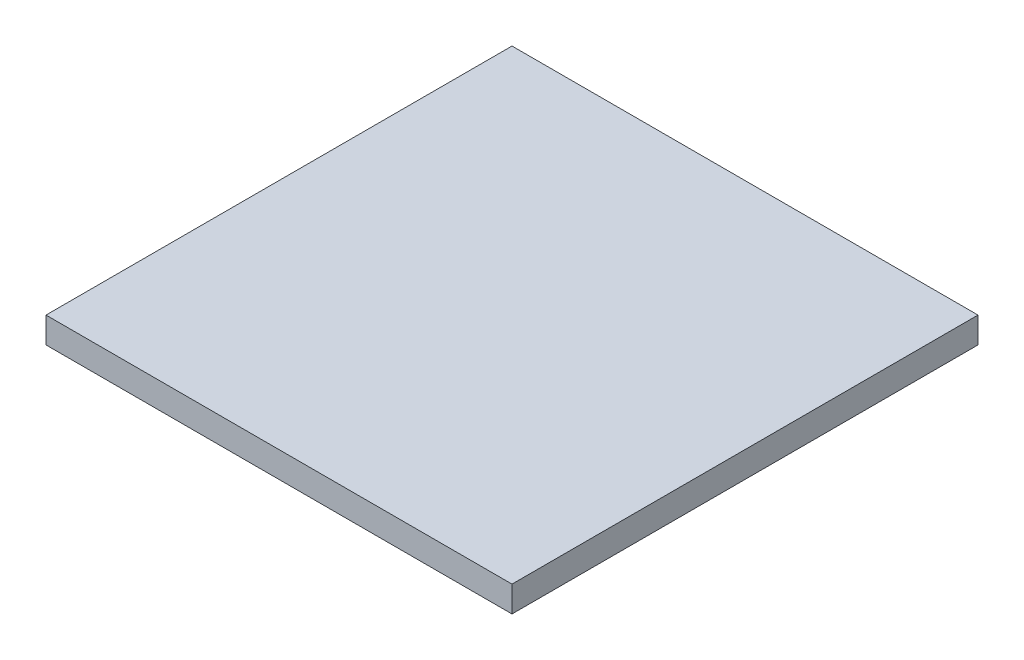
ISO-10303-21;
HEADER;
FILE_DESCRIPTION(('STEP AP214'),'2;1');
FILE_NAME('part.step','',(''),(''),'','','');
FILE_SCHEMA(('AUTOMOTIVE_DESIGN { 1 0 10303 214 1 1 1 1 }'));
ENDSEC;
DATA;
#1=APPLICATION_CONTEXT('core data for automotive mechanical design processes');
#2=APPLICATION_PROTOCOL_DEFINITION('international standard','automotive_design',2000,#1);
#3=PRODUCT_CONTEXT('',#1,'mechanical');
#4=PRODUCT('Part','Part','',(#3));
#5=PRODUCT_RELATED_PRODUCT_CATEGORY('part','',(#4));
#6=PRODUCT_DEFINITION_FORMATION('','',#4);
#7=PRODUCT_DEFINITION_CONTEXT('part definition',#1,'design');
#8=PRODUCT_DEFINITION('design','',#6,#7);
#9=PRODUCT_DEFINITION_SHAPE('','',#8);
#10=(LENGTH_UNIT() NAMED_UNIT(*) SI_UNIT(.MILLI.,.METRE.));
#11=(NAMED_UNIT(*) PLANE_ANGLE_UNIT() SI_UNIT($,.RADIAN.));
#12=(NAMED_UNIT(*) SI_UNIT($,.STERADIAN.) SOLID_ANGLE_UNIT());
#13=UNCERTAINTY_MEASURE_WITH_UNIT(LENGTH_MEASURE(1.E-05),#10,'distance_accuracy_value','');
#14=(GEOMETRIC_REPRESENTATION_CONTEXT(3) GLOBAL_UNCERTAINTY_ASSIGNED_CONTEXT((#13)) GLOBAL_UNIT_ASSIGNED_CONTEXT((#10,
#11,#12)) REPRESENTATION_CONTEXT('',''));
#15=CARTESIAN_POINT('',(0.,0.,0.));
#16=DIRECTION('',(0.,0.,1.));
#17=DIRECTION('',(1.,0.,0.));
#18=AXIS2_PLACEMENT_3D('',#15,#16,#17);
#19=CARTESIAN_POINT('',(-3.15,0.35,-3.15));
#20=DIRECTION('',(1.,0.,0.));
#21=DIRECTION('',(0.,0.,-1.));
#22=AXIS2_PLACEMENT_3D('',#19,#20,#21);
#23=PLANE('',#22);
#24=DIRECTION('',(0.,0.,1.));
#25=VECTOR('',#24,1.);
#26=CARTESIAN_POINT('',(-3.15,0.,-3.15));
#27=LINE('',#26,#25);
#28=CARTESIAN_POINT('',(-3.15,0.,-3.15));
#29=VERTEX_POINT('',#28);
#30=CARTESIAN_POINT('',(-3.15,0.,3.15));
#31=VERTEX_POINT('',#30);
#32=EDGE_CURVE('E100',#29,#31,#27,.T.);
#33=ORIENTED_EDGE('',*,*,#32,.T.);
#34=DIRECTION('',(0.,-1.,0.));
#35=VECTOR('',#34,1.);
#36=CARTESIAN_POINT('',(-3.15,0.35,3.15));
#37=LINE('',#36,#35);
#38=CARTESIAN_POINT('',(-3.15,0.35,3.15));
#39=VERTEX_POINT('',#38);
#40=EDGE_CURVE('E11',#39,#31,#37,.T.);
#41=ORIENTED_EDGE('',*,*,#40,.F.);
#42=DIRECTION('',(0.,0.,1.));
#43=VECTOR('',#42,1.);
#44=CARTESIAN_POINT('',(-3.15,0.35,-3.15));
#45=LINE('',#44,#43);
#46=CARTESIAN_POINT('',(-3.15,0.35,-3.15));
#47=VERTEX_POINT('',#46);
#48=EDGE_CURVE('E88',#47,#39,#45,.T.);
#49=ORIENTED_EDGE('',*,*,#48,.F.);
#50=DIRECTION('',(0.,-1.,0.));
#51=VECTOR('',#50,1.);
#52=CARTESIAN_POINT('',(-3.15,0.35,-3.15));
#53=LINE('',#52,#51);
#54=EDGE_CURVE('E96',#47,#29,#53,.T.);
#55=ORIENTED_EDGE('',*,*,#54,.T.);
#56=EDGE_LOOP('',(#33,#41,#49,#55));
#57=FACE_BOUND('',#56,.T.);
#58=ADVANCED_FACE('F37',(#57),#23,.F.);
#59=CARTESIAN_POINT('',(-3.15,0.35,3.15));
#60=DIRECTION('',(0.,0.,-1.));
#61=DIRECTION('',(-1.,0.,0.));
#62=AXIS2_PLACEMENT_3D('',#59,#60,#61);
#63=PLANE('',#62);
#64=DIRECTION('',(1.,0.,0.));
#65=VECTOR('',#64,1.);
#66=CARTESIAN_POINT('',(-3.15,0.,3.15));
#67=LINE('',#66,#65);
#68=CARTESIAN_POINT('',(3.15,0.,3.15));
#69=VERTEX_POINT('',#68);
#70=EDGE_CURVE('E92',#31,#69,#67,.T.);
#71=ORIENTED_EDGE('',*,*,#70,.T.);
#72=DIRECTION('',(0.,-1.,0.));
#73=VECTOR('',#72,1.);
#74=CARTESIAN_POINT('',(3.15,0.35,3.15));
#75=LINE('',#74,#73);
#76=CARTESIAN_POINT('',(3.15,0.35,3.15));
#77=VERTEX_POINT('',#76);
#78=EDGE_CURVE('E45',#77,#69,#75,.T.);
#79=ORIENTED_EDGE('',*,*,#78,.F.);
#80=DIRECTION('',(1.,0.,0.));
#81=VECTOR('',#80,1.);
#82=CARTESIAN_POINT('',(-3.15,0.35,3.15));
#83=LINE('',#82,#81);
#84=EDGE_CURVE('E83',#39,#77,#83,.T.);
#85=ORIENTED_EDGE('',*,*,#84,.F.);
#86=ORIENTED_EDGE('',*,*,#40,.T.);
#87=EDGE_LOOP('',(#71,#79,#85,#86));
#88=FACE_BOUND('',#87,.T.);
#89=ADVANCED_FACE('F91',(#88),#63,.F.);
#90=CARTESIAN_POINT('',(3.15,0.35,-3.15));
#91=DIRECTION('',(-1.,0.,0.));
#92=DIRECTION('',(0.,0.,1.));
#93=AXIS2_PLACEMENT_3D('',#90,#91,#92);
#94=PLANE('',#93);
#95=DIRECTION('',(0.,0.,-1.));
#96=VECTOR('',#95,1.);
#97=CARTESIAN_POINT('',(3.15,0.,-3.15));
#98=LINE('',#97,#96);
#99=CARTESIAN_POINT('',(3.15,0.,-3.15));
#100=VERTEX_POINT('',#99);
#101=EDGE_CURVE('E70',#69,#100,#98,.T.);
#102=ORIENTED_EDGE('',*,*,#101,.T.);
#103=DIRECTION('',(0.,-1.,0.));
#104=VECTOR('',#103,1.);
#105=CARTESIAN_POINT('',(3.15,0.35,-3.15));
#106=LINE('',#105,#104);
#107=CARTESIAN_POINT('',(3.15,0.35,-3.15));
#108=VERTEX_POINT('',#107);
#109=EDGE_CURVE('E93',#108,#100,#106,.T.);
#110=ORIENTED_EDGE('',*,*,#109,.F.);
#111=DIRECTION('',(0.,0.,-1.));
#112=VECTOR('',#111,1.);
#113=CARTESIAN_POINT('',(3.15,0.35,-3.15));
#114=LINE('',#113,#112);
#115=EDGE_CURVE('E86',#77,#108,#114,.T.);
#116=ORIENTED_EDGE('',*,*,#115,.F.);
#117=ORIENTED_EDGE('',*,*,#78,.T.);
#118=EDGE_LOOP('',(#102,#110,#116,#117));
#119=FACE_BOUND('',#118,.T.);
#120=ADVANCED_FACE('F94',(#119),#94,.F.);
#121=CARTESIAN_POINT('',(-3.15,0.35,-3.15));
#122=DIRECTION('',(0.,0.,1.));
#123=DIRECTION('',(1.,0.,0.));
#124=AXIS2_PLACEMENT_3D('',#121,#122,#123);
#125=PLANE('',#124);
#126=DIRECTION('',(-1.,0.,0.));
#127=VECTOR('',#126,1.);
#128=CARTESIAN_POINT('',(-3.15,0.,-3.15));
#129=LINE('',#128,#127);
#130=EDGE_CURVE('E76',#100,#29,#129,.T.);
#131=ORIENTED_EDGE('',*,*,#130,.T.);
#132=ORIENTED_EDGE('',*,*,#54,.F.);
#133=DIRECTION('',(-1.,0.,0.));
#134=VECTOR('',#133,1.);
#135=CARTESIAN_POINT('',(-3.15,0.35,-3.15));
#136=LINE('',#135,#134);
#137=EDGE_CURVE('E53',#108,#47,#136,.T.);
#138=ORIENTED_EDGE('',*,*,#137,.F.);
#139=ORIENTED_EDGE('',*,*,#109,.T.);
#140=EDGE_LOOP('',(#131,#132,#138,#139));
#141=FACE_BOUND('',#140,.T.);
#142=ADVANCED_FACE('F107',(#141),#125,.F.);
#143=CARTESIAN_POINT('',(0.,0.35,0.));
#144=DIRECTION('',(0.,1.,0.));
#145=DIRECTION('',(0.,0.,1.));
#146=AXIS2_PLACEMENT_3D('',#143,#144,#145);
#147=PLANE('',#146);
#148=ORIENTED_EDGE('',*,*,#48,.T.);
#149=ORIENTED_EDGE('',*,*,#84,.T.);
#150=ORIENTED_EDGE('',*,*,#115,.T.);
#151=ORIENTED_EDGE('',*,*,#137,.T.);
#152=EDGE_LOOP('',(#148,#149,#150,#151));
#153=FACE_BOUND('',#152,.T.);
#154=ADVANCED_FACE('F84',(#153),#147,.T.);
#155=CARTESIAN_POINT('',(0.,0.,0.));
#156=DIRECTION('',(0.,1.,0.));
#157=DIRECTION('',(0.,0.,1.));
#158=AXIS2_PLACEMENT_3D('',#155,#156,#157);
#159=PLANE('',#158);
#160=ORIENTED_EDGE('',*,*,#32,.F.);
#161=ORIENTED_EDGE('',*,*,#130,.F.);
#162=ORIENTED_EDGE('',*,*,#101,.F.);
#163=ORIENTED_EDGE('',*,*,#70,.F.);
#164=EDGE_LOOP('',(#160,#161,#162,#163));
#165=FACE_BOUND('',#164,.T.);
#166=ADVANCED_FACE('F110',(#165),#159,.F.);
#167=CLOSED_SHELL('',(#58,#89,#120,#142,#154,#166));
#168=MANIFOLD_SOLID_BREP('B2',#167);
#169=ADVANCED_BREP_SHAPE_REPRESENTATION('',(#18,#168),#14);
#170=SHAPE_DEFINITION_REPRESENTATION(#9,#169);
ENDSEC;
END-ISO-10303-21;
